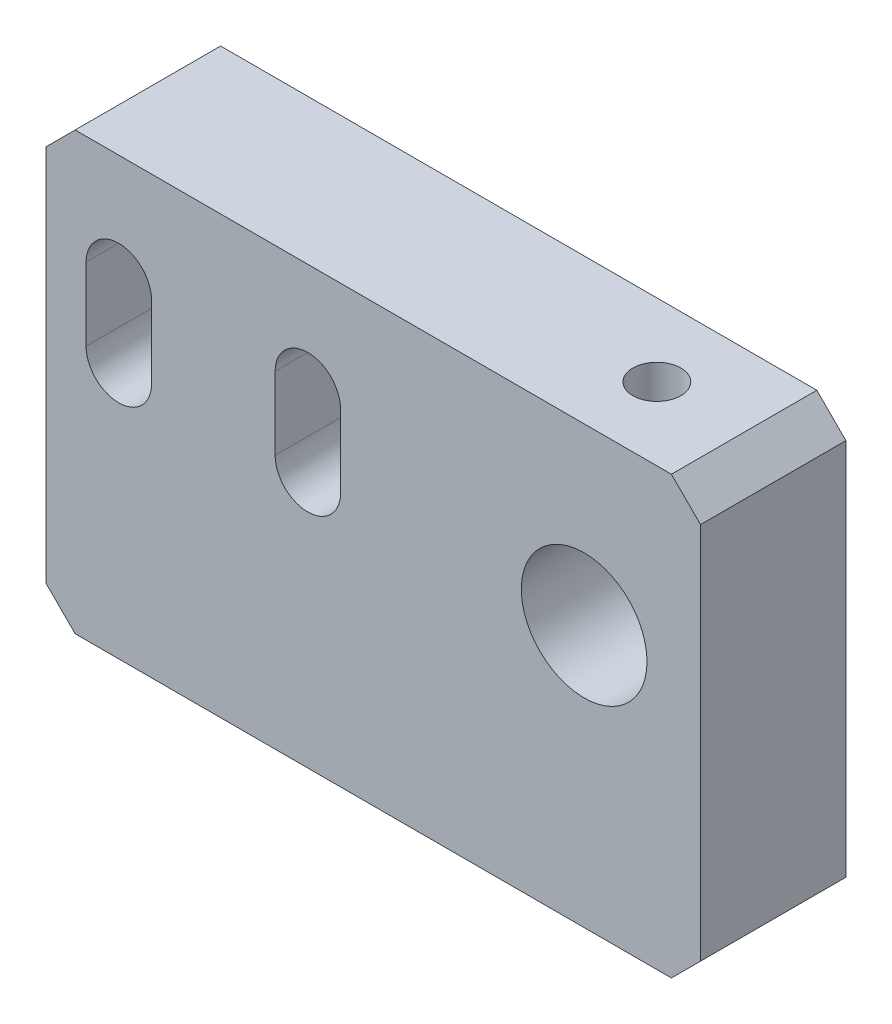
ISO-10303-21;
HEADER;
FILE_DESCRIPTION(('STEP AP214'),'2;1');
FILE_NAME('part.step','',(''),(''),'','','');
FILE_SCHEMA(('AUTOMOTIVE_DESIGN { 1 0 10303 214 1 1 1 1 }'));
ENDSEC;
DATA;
#1=APPLICATION_CONTEXT('core data for automotive mechanical design processes');
#2=APPLICATION_PROTOCOL_DEFINITION('international standard','automotive_design',2000,#1);
#3=PRODUCT_CONTEXT('',#1,'mechanical');
#4=PRODUCT('Part','Part','',(#3));
#5=PRODUCT_RELATED_PRODUCT_CATEGORY('part','',(#4));
#6=PRODUCT_DEFINITION_FORMATION('','',#4);
#7=PRODUCT_DEFINITION_CONTEXT('part definition',#1,'design');
#8=PRODUCT_DEFINITION('design','',#6,#7);
#9=PRODUCT_DEFINITION_SHAPE('','',#8);
#10=(LENGTH_UNIT() NAMED_UNIT(*) SI_UNIT(.MILLI.,.METRE.));
#11=(NAMED_UNIT(*) PLANE_ANGLE_UNIT() SI_UNIT($,.RADIAN.));
#12=(NAMED_UNIT(*) SI_UNIT($,.STERADIAN.) SOLID_ANGLE_UNIT());
#13=UNCERTAINTY_MEASURE_WITH_UNIT(LENGTH_MEASURE(1.E-05),#10,'distance_accuracy_value','');
#14=(GEOMETRIC_REPRESENTATION_CONTEXT(3) GLOBAL_UNCERTAINTY_ASSIGNED_CONTEXT((#13)) GLOBAL_UNIT_ASSIGNED_CONTEXT((#10,
#11,#12)) REPRESENTATION_CONTEXT('',''));
#15=CARTESIAN_POINT('',(0.,0.,0.));
#16=DIRECTION('',(0.,0.,1.));
#17=DIRECTION('',(1.,0.,0.));
#18=AXIS2_PLACEMENT_3D('',#15,#16,#17);
#19=CARTESIAN_POINT('',(0.,0.,10.));
#20=DIRECTION('',(0.,0.,1.));
#21=DIRECTION('',(1.,0.,0.));
#22=AXIS2_PLACEMENT_3D('',#19,#20,#21);
#23=PLANE('',#22);
#24=DIRECTION('',(0.,-1.,0.));
#25=VECTOR('',#24,1.);
#26=CARTESIAN_POINT('',(1.24253731343286,5.,10.));
#27=LINE('',#26,#25);
#28=CARTESIAN_POINT('',(1.24253731343286,5.,10.));
#29=VERTEX_POINT('',#28);
#30=CARTESIAN_POINT('',(1.24253731343286,0.,10.));
#31=VERTEX_POINT('',#30);
#32=EDGE_CURVE('E161',#29,#31,#27,.T.);
#33=ORIENTED_EDGE('',*,*,#32,.F.);
#34=CARTESIAN_POINT('',(3.49253731343286,5.,10.));
#35=DIRECTION('',(0.,0.,1.));
#36=DIRECTION('',(1.,0.,0.));
#37=AXIS2_PLACEMENT_3D('',#34,#35,#36);
#38=CIRCLE('',#37,2.25);
#39=CARTESIAN_POINT('',(5.74253731343286,5.,10.));
#40=VERTEX_POINT('',#39);
#41=EDGE_CURVE('E151',#40,#29,#38,.T.);
#42=ORIENTED_EDGE('',*,*,#41,.F.);
#43=DIRECTION('',(0.,1.,0.));
#44=VECTOR('',#43,1.);
#45=CARTESIAN_POINT('',(5.74253731343286,5.,10.));
#46=LINE('',#45,#44);
#47=CARTESIAN_POINT('',(5.74253731343286,0.,10.));
#48=VERTEX_POINT('',#47);
#49=EDGE_CURVE('E177',#48,#40,#46,.T.);
#50=ORIENTED_EDGE('',*,*,#49,.F.);
#51=CARTESIAN_POINT('',(3.49253731343286,0.,10.));
#52=DIRECTION('',(0.,0.,1.));
#53=DIRECTION('',(1.,0.,0.));
#54=AXIS2_PLACEMENT_3D('',#51,#52,#53);
#55=CIRCLE('',#54,2.25);
#56=EDGE_CURVE('E175',#31,#48,#55,.T.);
#57=ORIENTED_EDGE('',*,*,#56,.F.);
#58=EDGE_LOOP('',(#33,#42,#50,#57));
#59=FACE_BOUND('',#58,.T.);
#60=DIRECTION('',(0.,-1.,0.));
#61=VECTOR('',#60,1.);
#62=CARTESIAN_POINT('',(-11.7574626865671,5.,10.));
#63=LINE('',#62,#61);
#64=CARTESIAN_POINT('',(-11.7574626865671,5.,10.));
#65=VERTEX_POINT('',#64);
#66=CARTESIAN_POINT('',(-11.7574626865671,0.,10.));
#67=VERTEX_POINT('',#66);
#68=EDGE_CURVE('E197',#65,#67,#63,.T.);
#69=ORIENTED_EDGE('',*,*,#68,.F.);
#70=CARTESIAN_POINT('',(-9.50746268656714,5.,10.));
#71=DIRECTION('',(0.,0.,1.));
#72=DIRECTION('',(1.,0.,0.));
#73=AXIS2_PLACEMENT_3D('',#70,#71,#72);
#74=CIRCLE('',#73,2.25);
#75=CARTESIAN_POINT('',(-7.25746268656715,5.,10.));
#76=VERTEX_POINT('',#75);
#77=EDGE_CURVE('E195',#76,#65,#74,.T.);
#78=ORIENTED_EDGE('',*,*,#77,.F.);
#79=DIRECTION('',(0.,1.,0.));
#80=VECTOR('',#79,1.);
#81=CARTESIAN_POINT('',(-7.25746268656715,5.,10.));
#82=LINE('',#81,#80);
#83=CARTESIAN_POINT('',(-7.25746268656715,0.,10.));
#84=VERTEX_POINT('',#83);
#85=EDGE_CURVE('E203',#84,#76,#82,.T.);
#86=ORIENTED_EDGE('',*,*,#85,.F.);
#87=CARTESIAN_POINT('',(-9.50746268656714,0.,10.));
#88=DIRECTION('',(0.,0.,1.));
#89=DIRECTION('',(1.,0.,0.));
#90=AXIS2_PLACEMENT_3D('',#87,#88,#89);
#91=CIRCLE('',#90,2.25);
#92=EDGE_CURVE('E200',#67,#84,#91,.T.);
#93=ORIENTED_EDGE('',*,*,#92,.F.);
#94=EDGE_LOOP('',(#69,#78,#86,#93));
#95=FACE_BOUND('',#94,.T.);
#96=DIRECTION('',(-1.,0.,0.));
#97=VECTOR('',#96,1.);
#98=CARTESIAN_POINT('',(-14.5074626865671,12.5,10.));
#99=LINE('',#98,#97);
#100=CARTESIAN_POINT('',(28.4925373134328,12.5,10.));
#101=VERTEX_POINT('',#100);
#102=CARTESIAN_POINT('',(-12.5074626865671,12.5,10.));
#103=VERTEX_POINT('',#102);
#104=EDGE_CURVE('E234',#101,#103,#99,.T.);
#105=ORIENTED_EDGE('',*,*,#104,.T.);
#106=DIRECTION('',(0.707106781186548,0.707106781186548,0.));
#107=VECTOR('',#106,1.);
#108=CARTESIAN_POINT('',(-12.5037313432836,12.5037313432836,10.));
#109=LINE('',#108,#107);
#110=CARTESIAN_POINT('',(-14.5074626865671,10.5,10.));
#111=VERTEX_POINT('',#110);
#112=EDGE_CURVE('E318',#103,#111,#109,.F.);
#113=ORIENTED_EDGE('',*,*,#112,.T.);
#114=DIRECTION('',(0.,-1.,0.));
#115=VECTOR('',#114,1.);
#116=CARTESIAN_POINT('',(-14.5074626865671,12.5,10.));
#117=LINE('',#116,#115);
#118=CARTESIAN_POINT('',(-14.5074626865671,-15.5,10.));
#119=VERTEX_POINT('',#118);
#120=EDGE_CURVE('E226',#111,#119,#117,.T.);
#121=ORIENTED_EDGE('',*,*,#120,.T.);
#122=DIRECTION('',(-0.707106781186546,0.707106781186549,0.));
#123=VECTOR('',#122,1.);
#124=CARTESIAN_POINT('',(-15.0037313432836,-15.0037313432835,10.));
#125=LINE('',#124,#123);
#126=CARTESIAN_POINT('',(-12.5074626865671,-17.5,10.));
#127=VERTEX_POINT('',#126);
#128=EDGE_CURVE('E314',#119,#127,#125,.F.);
#129=ORIENTED_EDGE('',*,*,#128,.T.);
#130=DIRECTION('',(1.,0.,0.));
#131=VECTOR('',#130,1.);
#132=CARTESIAN_POINT('',(-14.5074626865671,-17.5,10.));
#133=LINE('',#132,#131);
#134=CARTESIAN_POINT('',(28.4925373134329,-17.5,10.));
#135=VERTEX_POINT('',#134);
#136=EDGE_CURVE('E229',#127,#135,#133,.T.);
#137=ORIENTED_EDGE('',*,*,#136,.T.);
#138=DIRECTION('',(-0.707106781186548,-0.707106781186548,0.));
#139=VECTOR('',#138,1.);
#140=CARTESIAN_POINT('',(22.9962686567164,-22.9962686567164,10.));
#141=LINE('',#140,#139);
#142=CARTESIAN_POINT('',(30.4925373134329,-15.5,10.));
#143=VERTEX_POINT('',#142);
#144=EDGE_CURVE('E57',#135,#143,#141,.F.);
#145=ORIENTED_EDGE('',*,*,#144,.T.);
#146=DIRECTION('',(0.,1.,0.));
#147=VECTOR('',#146,1.);
#148=CARTESIAN_POINT('',(30.4925373134329,12.5,10.));
#149=LINE('',#148,#147);
#150=CARTESIAN_POINT('',(30.4925373134329,10.5,10.));
#151=VERTEX_POINT('',#150);
#152=EDGE_CURVE('E232',#143,#151,#149,.T.);
#153=ORIENTED_EDGE('',*,*,#152,.T.);
#154=DIRECTION('',(0.707106781186546,-0.707106781186549,0.));
#155=VECTOR('',#154,1.);
#156=CARTESIAN_POINT('',(20.4962686567165,20.4962686567164,10.));
#157=LINE('',#156,#155);
#158=EDGE_CURVE('E316',#151,#101,#157,.F.);
#159=ORIENTED_EDGE('',*,*,#158,.T.);
#160=EDGE_LOOP('',(#105,#113,#121,#129,#137,#145,#153,#159));
#161=FACE_BOUND('',#160,.T.);
#162=CARTESIAN_POINT('',(22.4925373134329,0.499999999999997,10.));
#163=DIRECTION('',(0.,0.,1.));
#164=DIRECTION('',(1.,0.,0.));
#165=AXIS2_PLACEMENT_3D('',#162,#163,#164);
#166=CIRCLE('',#165,4.3220553698139);
#167=CARTESIAN_POINT('',(26.8145926832468,0.499999999999997,10.));
#168=VERTEX_POINT('',#167);
#169=EDGE_CURVE('E184',#168,#168,#166,.T.);
#170=ORIENTED_EDGE('',*,*,#169,.F.);
#171=EDGE_LOOP('',(#170));
#172=FACE_BOUND('',#171,.T.);
#173=ADVANCED_FACE('F35',(#59,#95,#161,#172),#23,.T.);
#174=CARTESIAN_POINT('',(0.,0.,0.));
#175=DIRECTION('',(0.,0.,1.));
#176=DIRECTION('',(1.,0.,0.));
#177=AXIS2_PLACEMENT_3D('',#174,#175,#176);
#178=PLANE('',#177);
#179=CARTESIAN_POINT('',(-9.50746268656714,5.,0.));
#180=DIRECTION('',(0.,0.,1.));
#181=DIRECTION('',(1.,0.,0.));
#182=AXIS2_PLACEMENT_3D('',#179,#180,#181);
#183=CIRCLE('',#182,2.25);
#184=CARTESIAN_POINT('',(-7.25746268656715,5.,0.));
#185=VERTEX_POINT('',#184);
#186=CARTESIAN_POINT('',(-11.7574626865671,5.,0.));
#187=VERTEX_POINT('',#186);
#188=EDGE_CURVE('E169',#185,#187,#183,.T.);
#189=ORIENTED_EDGE('',*,*,#188,.T.);
#190=DIRECTION('',(0.,-1.,0.));
#191=VECTOR('',#190,1.);
#192=CARTESIAN_POINT('',(-11.7574626865671,5.,0.));
#193=LINE('',#192,#191);
#194=CARTESIAN_POINT('',(-11.7574626865671,0.,0.));
#195=VERTEX_POINT('',#194);
#196=EDGE_CURVE('E208',#187,#195,#193,.T.);
#197=ORIENTED_EDGE('',*,*,#196,.T.);
#198=CARTESIAN_POINT('',(-9.50746268656714,0.,0.));
#199=DIRECTION('',(0.,0.,1.));
#200=DIRECTION('',(1.,0.,0.));
#201=AXIS2_PLACEMENT_3D('',#198,#199,#200);
#202=CIRCLE('',#201,2.25);
#203=CARTESIAN_POINT('',(-7.25746268656715,0.,0.));
#204=VERTEX_POINT('',#203);
#205=EDGE_CURVE('E211',#195,#204,#202,.T.);
#206=ORIENTED_EDGE('',*,*,#205,.T.);
#207=DIRECTION('',(0.,1.,0.));
#208=VECTOR('',#207,1.);
#209=CARTESIAN_POINT('',(-7.25746268656715,5.,0.));
#210=LINE('',#209,#208);
#211=EDGE_CURVE('E198',#204,#185,#210,.T.);
#212=ORIENTED_EDGE('',*,*,#211,.T.);
#213=EDGE_LOOP('',(#189,#197,#206,#212));
#214=FACE_BOUND('',#213,.T.);
#215=DIRECTION('',(0.,-1.,0.));
#216=VECTOR('',#215,1.);
#217=CARTESIAN_POINT('',(-14.5074626865671,12.5,0.));
#218=LINE('',#217,#216);
#219=CARTESIAN_POINT('',(-14.5074626865671,10.5,0.));
#220=VERTEX_POINT('',#219);
#221=CARTESIAN_POINT('',(-14.5074626865671,-15.5,0.));
#222=VERTEX_POINT('',#221);
#223=EDGE_CURVE('E225',#220,#222,#218,.T.);
#224=ORIENTED_EDGE('',*,*,#223,.F.);
#225=DIRECTION('',(-0.707106781186548,-0.707106781186548,0.));
#226=VECTOR('',#225,1.);
#227=CARTESIAN_POINT('',(-14.5074626865671,10.5,0.));
#228=LINE('',#227,#226);
#229=CARTESIAN_POINT('',(-12.5074626865671,12.5,0.));
#230=VERTEX_POINT('',#229);
#231=EDGE_CURVE('E341',#220,#230,#228,.F.);
#232=ORIENTED_EDGE('',*,*,#231,.T.);
#233=DIRECTION('',(-1.,0.,0.));
#234=VECTOR('',#233,1.);
#235=CARTESIAN_POINT('',(-14.5074626865671,12.5,0.));
#236=LINE('',#235,#234);
#237=CARTESIAN_POINT('',(28.4925373134328,12.5,0.));
#238=VERTEX_POINT('',#237);
#239=EDGE_CURVE('E230',#238,#230,#236,.T.);
#240=ORIENTED_EDGE('',*,*,#239,.F.);
#241=DIRECTION('',(-0.707106781186546,0.707106781186549,0.));
#242=VECTOR('',#241,1.);
#243=CARTESIAN_POINT('',(28.4925373134329,12.5,0.));
#244=LINE('',#243,#242);
#245=CARTESIAN_POINT('',(30.4925373134329,10.5,0.));
#246=VERTEX_POINT('',#245);
#247=EDGE_CURVE('E338',#238,#246,#244,.F.);
#248=ORIENTED_EDGE('',*,*,#247,.T.);
#249=DIRECTION('',(0.,1.,0.));
#250=VECTOR('',#249,1.);
#251=CARTESIAN_POINT('',(30.4925373134329,12.5,0.));
#252=LINE('',#251,#250);
#253=CARTESIAN_POINT('',(30.4925373134329,-15.5,0.));
#254=VERTEX_POINT('',#253);
#255=EDGE_CURVE('E243',#254,#246,#252,.T.);
#256=ORIENTED_EDGE('',*,*,#255,.F.);
#257=DIRECTION('',(0.707106781186548,0.707106781186548,0.));
#258=VECTOR('',#257,1.);
#259=CARTESIAN_POINT('',(30.4925373134329,-15.5,0.));
#260=LINE('',#259,#258);
#261=CARTESIAN_POINT('',(28.4925373134329,-17.5,0.));
#262=VERTEX_POINT('',#261);
#263=EDGE_CURVE('E332',#254,#262,#260,.F.);
#264=ORIENTED_EDGE('',*,*,#263,.T.);
#265=DIRECTION('',(1.,0.,0.));
#266=VECTOR('',#265,1.);
#267=CARTESIAN_POINT('',(-14.5074626865671,-17.5,0.));
#268=LINE('',#267,#266);
#269=CARTESIAN_POINT('',(-12.5074626865671,-17.5,0.));
#270=VERTEX_POINT('',#269);
#271=EDGE_CURVE('E240',#270,#262,#268,.T.);
#272=ORIENTED_EDGE('',*,*,#271,.F.);
#273=DIRECTION('',(0.707106781186546,-0.707106781186549,0.));
#274=VECTOR('',#273,1.);
#275=CARTESIAN_POINT('',(-12.5074626865671,-17.5,0.));
#276=LINE('',#275,#274);
#277=EDGE_CURVE('E342',#270,#222,#276,.F.);
#278=ORIENTED_EDGE('',*,*,#277,.T.);
#279=EDGE_LOOP('',(#224,#232,#240,#248,#256,#264,#272,#278));
#280=FACE_BOUND('',#279,.T.);
#281=CARTESIAN_POINT('',(3.49253731343286,5.,0.));
#282=DIRECTION('',(0.,0.,1.));
#283=DIRECTION('',(1.,0.,0.));
#284=AXIS2_PLACEMENT_3D('',#281,#282,#283);
#285=CIRCLE('',#284,2.25);
#286=CARTESIAN_POINT('',(5.74253731343286,5.,0.));
#287=VERTEX_POINT('',#286);
#288=CARTESIAN_POINT('',(1.24253731343286,5.,0.));
#289=VERTEX_POINT('',#288);
#290=EDGE_CURVE('E182',#287,#289,#285,.T.);
#291=ORIENTED_EDGE('',*,*,#290,.T.);
#292=DIRECTION('',(0.,-1.,0.));
#293=VECTOR('',#292,1.);
#294=CARTESIAN_POINT('',(1.24253731343286,5.,0.));
#295=LINE('',#294,#293);
#296=CARTESIAN_POINT('',(1.24253731343286,0.,0.));
#297=VERTEX_POINT('',#296);
#298=EDGE_CURVE('E168',#289,#297,#295,.T.);
#299=ORIENTED_EDGE('',*,*,#298,.T.);
#300=CARTESIAN_POINT('',(3.49253731343286,0.,0.));
#301=DIRECTION('',(0.,0.,1.));
#302=DIRECTION('',(1.,0.,0.));
#303=AXIS2_PLACEMENT_3D('',#300,#301,#302);
#304=CIRCLE('',#303,2.25);
#305=CARTESIAN_POINT('',(5.74253731343286,0.,0.));
#306=VERTEX_POINT('',#305);
#307=EDGE_CURVE('E186',#297,#306,#304,.T.);
#308=ORIENTED_EDGE('',*,*,#307,.T.);
#309=DIRECTION('',(0.,1.,0.));
#310=VECTOR('',#309,1.);
#311=CARTESIAN_POINT('',(5.74253731343286,5.,0.));
#312=LINE('',#311,#310);
#313=EDGE_CURVE('E162',#306,#287,#312,.T.);
#314=ORIENTED_EDGE('',*,*,#313,.T.);
#315=EDGE_LOOP('',(#291,#299,#308,#314));
#316=FACE_BOUND('',#315,.T.);
#317=CARTESIAN_POINT('',(22.4925373134329,0.499999999999997,0.));
#318=DIRECTION('',(0.,0.,1.));
#319=DIRECTION('',(1.,0.,0.));
#320=AXIS2_PLACEMENT_3D('',#317,#318,#319);
#321=CIRCLE('',#320,4.3220553698139);
#322=CARTESIAN_POINT('',(26.8145926832468,0.499999999999997,0.));
#323=VERTEX_POINT('',#322);
#324=EDGE_CURVE('E254',#323,#323,#321,.T.);
#325=ORIENTED_EDGE('',*,*,#324,.T.);
#326=EDGE_LOOP('',(#325));
#327=FACE_BOUND('',#326,.T.);
#328=ADVANCED_FACE('F276',(#214,#280,#316,#327),#178,.F.);
#329=CARTESIAN_POINT('',(-14.5074626865671,12.5,10.));
#330=DIRECTION('',(1.,0.,0.));
#331=DIRECTION('',(0.,1.,0.));
#332=AXIS2_PLACEMENT_3D('',#329,#330,#331);
#333=PLANE('',#332);
#334=ORIENTED_EDGE('',*,*,#120,.F.);
#335=DIRECTION('',(0.,0.,-1.));
#336=VECTOR('',#335,1.);
#337=CARTESIAN_POINT('',(-14.5074626865671,10.5,10.));
#338=LINE('',#337,#336);
#339=EDGE_CURVE('E357',#111,#220,#338,.T.);
#340=ORIENTED_EDGE('',*,*,#339,.T.);
#341=ORIENTED_EDGE('',*,*,#223,.T.);
#342=DIRECTION('',(0.,0.,1.));
#343=VECTOR('',#342,1.);
#344=CARTESIAN_POINT('',(-14.5074626865671,-15.5,10.));
#345=LINE('',#344,#343);
#346=EDGE_CURVE('E237',#222,#119,#345,.T.);
#347=ORIENTED_EDGE('',*,*,#346,.T.);
#348=EDGE_LOOP('',(#334,#340,#341,#347));
#349=FACE_BOUND('',#348,.T.);
#350=ADVANCED_FACE('F281',(#349),#333,.F.);
#351=CARTESIAN_POINT('',(-14.5074626865671,-17.5,10.));
#352=DIRECTION('',(0.,1.,0.));
#353=DIRECTION('',(0.,0.,1.));
#354=AXIS2_PLACEMENT_3D('',#351,#352,#353);
#355=PLANE('',#354);
#356=ORIENTED_EDGE('',*,*,#136,.F.);
#357=DIRECTION('',(0.,0.,-1.));
#358=VECTOR('',#357,1.);
#359=CARTESIAN_POINT('',(-12.5074626865671,-17.5,10.));
#360=LINE('',#359,#358);
#361=EDGE_CURVE('E11',#127,#270,#360,.T.);
#362=ORIENTED_EDGE('',*,*,#361,.T.);
#363=ORIENTED_EDGE('',*,*,#271,.T.);
#364=DIRECTION('',(0.,0.,1.));
#365=VECTOR('',#364,1.);
#366=CARTESIAN_POINT('',(28.4925373134329,-17.5,10.));
#367=LINE('',#366,#365);
#368=EDGE_CURVE('E43',#262,#135,#367,.T.);
#369=ORIENTED_EDGE('',*,*,#368,.T.);
#370=EDGE_LOOP('',(#356,#362,#363,#369));
#371=FACE_BOUND('',#370,.T.);
#372=ADVANCED_FACE('F295',(#371),#355,.F.);
#373=CARTESIAN_POINT('',(30.4925373134329,12.5,10.));
#374=DIRECTION('',(-1.,0.,0.));
#375=DIRECTION('',(0.,-1.,0.));
#376=AXIS2_PLACEMENT_3D('',#373,#374,#375);
#377=PLANE('',#376);
#378=ORIENTED_EDGE('',*,*,#255,.T.);
#379=DIRECTION('',(0.,0.,1.));
#380=VECTOR('',#379,1.);
#381=CARTESIAN_POINT('',(30.4925373134329,10.5,10.));
#382=LINE('',#381,#380);
#383=EDGE_CURVE('E50',#246,#151,#382,.T.);
#384=ORIENTED_EDGE('',*,*,#383,.T.);
#385=ORIENTED_EDGE('',*,*,#152,.F.);
#386=DIRECTION('',(0.,0.,-1.));
#387=VECTOR('',#386,1.);
#388=CARTESIAN_POINT('',(30.4925373134329,-15.5,10.));
#389=LINE('',#388,#387);
#390=EDGE_CURVE('E325',#143,#254,#389,.T.);
#391=ORIENTED_EDGE('',*,*,#390,.T.);
#392=EDGE_LOOP('',(#378,#384,#385,#391));
#393=FACE_BOUND('',#392,.T.);
#394=ADVANCED_FACE('F291',(#393),#377,.F.);
#395=CARTESIAN_POINT('',(-14.5074626865671,12.5,10.));
#396=DIRECTION('',(0.,-1.,0.));
#397=DIRECTION('',(0.,0.,-1.));
#398=AXIS2_PLACEMENT_3D('',#395,#396,#397);
#399=PLANE('',#398);
#400=CARTESIAN_POINT('',(22.4925373134329,12.5,5.));
#401=DIRECTION('',(0.,1.,0.));
#402=DIRECTION('',(0.,0.,1.));
#403=AXIS2_PLACEMENT_3D('',#400,#401,#402);
#404=CIRCLE('',#403,1.65);
#405=CARTESIAN_POINT('',(22.4925373134329,12.5,6.65));
#406=VERTEX_POINT('',#405);
#407=EDGE_CURVE('E255',#406,#406,#404,.T.);
#408=ORIENTED_EDGE('',*,*,#407,.F.);
#409=EDGE_LOOP('',(#408));
#410=FACE_BOUND('',#409,.T.);
#411=ORIENTED_EDGE('',*,*,#239,.T.);
#412=DIRECTION('',(0.,0.,1.));
#413=VECTOR('',#412,1.);
#414=CARTESIAN_POINT('',(-12.5074626865671,12.5,10.));
#415=LINE('',#414,#413);
#416=EDGE_CURVE('E320',#230,#103,#415,.T.);
#417=ORIENTED_EDGE('',*,*,#416,.T.);
#418=ORIENTED_EDGE('',*,*,#104,.F.);
#419=DIRECTION('',(0.,0.,-1.));
#420=VECTOR('',#419,1.);
#421=CARTESIAN_POINT('',(28.4925373134329,12.5,10.));
#422=LINE('',#421,#420);
#423=EDGE_CURVE('E344',#101,#238,#422,.T.);
#424=ORIENTED_EDGE('',*,*,#423,.T.);
#425=EDGE_LOOP('',(#411,#417,#418,#424));
#426=FACE_BOUND('',#425,.T.);
#427=ADVANCED_FACE('F288',(#410,#426),#399,.F.);
#428=CARTESIAN_POINT('',(-9.50746268656714,5.,10.));
#429=DIRECTION('',(0.,0.,-1.));
#430=DIRECTION('',(-1.,0.,0.));
#431=AXIS2_PLACEMENT_3D('',#428,#429,#430);
#432=CYLINDRICAL_SURFACE('',#431,2.25);
#433=ORIENTED_EDGE('',*,*,#188,.F.);
#434=DIRECTION('',(0.,0.,-1.));
#435=VECTOR('',#434,1.);
#436=CARTESIAN_POINT('',(-7.25746268656715,5.,10.));
#437=LINE('',#436,#435);
#438=EDGE_CURVE('E205',#76,#185,#437,.T.);
#439=ORIENTED_EDGE('',*,*,#438,.F.);
#440=ORIENTED_EDGE('',*,*,#77,.T.);
#441=DIRECTION('',(0.,0.,-1.));
#442=VECTOR('',#441,1.);
#443=CARTESIAN_POINT('',(-11.7574626865671,5.,10.));
#444=LINE('',#443,#442);
#445=EDGE_CURVE('E222',#65,#187,#444,.T.);
#446=ORIENTED_EDGE('',*,*,#445,.T.);
#447=EDGE_LOOP('',(#433,#439,#440,#446));
#448=FACE_BOUND('',#447,.T.);
#449=ADVANCED_FACE('F285',(#448),#432,.F.);
#450=CARTESIAN_POINT('',(-11.7574626865671,5.,10.));
#451=DIRECTION('',(1.,0.,0.));
#452=DIRECTION('',(0.,1.,0.));
#453=AXIS2_PLACEMENT_3D('',#450,#451,#452);
#454=PLANE('',#453);
#455=ORIENTED_EDGE('',*,*,#196,.F.);
#456=ORIENTED_EDGE('',*,*,#445,.F.);
#457=ORIENTED_EDGE('',*,*,#68,.T.);
#458=DIRECTION('',(0.,0.,-1.));
#459=VECTOR('',#458,1.);
#460=CARTESIAN_POINT('',(-11.7574626865671,0.,10.));
#461=LINE('',#460,#459);
#462=EDGE_CURVE('E220',#67,#195,#461,.T.);
#463=ORIENTED_EDGE('',*,*,#462,.T.);
#464=EDGE_LOOP('',(#455,#456,#457,#463));
#465=FACE_BOUND('',#464,.T.);
#466=ADVANCED_FACE('F390',(#465),#454,.T.);
#467=CARTESIAN_POINT('',(-9.50746268656714,0.,10.));
#468=DIRECTION('',(0.,0.,-1.));
#469=DIRECTION('',(-1.,0.,0.));
#470=AXIS2_PLACEMENT_3D('',#467,#468,#469);
#471=CYLINDRICAL_SURFACE('',#470,2.25);
#472=ORIENTED_EDGE('',*,*,#205,.F.);
#473=ORIENTED_EDGE('',*,*,#462,.F.);
#474=ORIENTED_EDGE('',*,*,#92,.T.);
#475=DIRECTION('',(0.,0.,-1.));
#476=VECTOR('',#475,1.);
#477=CARTESIAN_POINT('',(-7.25746268656715,0.,10.));
#478=LINE('',#477,#476);
#479=EDGE_CURVE('E218',#84,#204,#478,.T.);
#480=ORIENTED_EDGE('',*,*,#479,.T.);
#481=EDGE_LOOP('',(#472,#473,#474,#480));
#482=FACE_BOUND('',#481,.T.);
#483=ADVANCED_FACE('F387',(#482),#471,.F.);
#484=CARTESIAN_POINT('',(-7.25746268656715,5.,10.));
#485=DIRECTION('',(-1.,0.,0.));
#486=DIRECTION('',(0.,-1.,0.));
#487=AXIS2_PLACEMENT_3D('',#484,#485,#486);
#488=PLANE('',#487);
#489=ORIENTED_EDGE('',*,*,#211,.F.);
#490=ORIENTED_EDGE('',*,*,#479,.F.);
#491=ORIENTED_EDGE('',*,*,#85,.T.);
#492=ORIENTED_EDGE('',*,*,#438,.T.);
#493=EDGE_LOOP('',(#489,#490,#491,#492));
#494=FACE_BOUND('',#493,.T.);
#495=ADVANCED_FACE('F384',(#494),#488,.T.);
#496=CARTESIAN_POINT('',(3.49253731343286,5.,10.));
#497=DIRECTION('',(0.,0.,-1.));
#498=DIRECTION('',(-1.,0.,0.));
#499=AXIS2_PLACEMENT_3D('',#496,#497,#498);
#500=CYLINDRICAL_SURFACE('',#499,2.25);
#501=ORIENTED_EDGE('',*,*,#290,.F.);
#502=DIRECTION('',(0.,0.,-1.));
#503=VECTOR('',#502,1.);
#504=CARTESIAN_POINT('',(5.74253731343286,5.,10.));
#505=LINE('',#504,#503);
#506=EDGE_CURVE('E157',#40,#287,#505,.T.);
#507=ORIENTED_EDGE('',*,*,#506,.F.);
#508=ORIENTED_EDGE('',*,*,#41,.T.);
#509=DIRECTION('',(0.,0.,-1.));
#510=VECTOR('',#509,1.);
#511=CARTESIAN_POINT('',(1.24253731343286,5.,10.));
#512=LINE('',#511,#510);
#513=EDGE_CURVE('E154',#29,#289,#512,.T.);
#514=ORIENTED_EDGE('',*,*,#513,.T.);
#515=EDGE_LOOP('',(#501,#507,#508,#514));
#516=FACE_BOUND('',#515,.T.);
#517=ADVANCED_FACE('F153',(#516),#500,.F.);
#518=CARTESIAN_POINT('',(1.24253731343286,5.,10.));
#519=DIRECTION('',(1.,0.,0.));
#520=DIRECTION('',(0.,1.,0.));
#521=AXIS2_PLACEMENT_3D('',#518,#519,#520);
#522=PLANE('',#521);
#523=ORIENTED_EDGE('',*,*,#298,.F.);
#524=ORIENTED_EDGE('',*,*,#513,.F.);
#525=ORIENTED_EDGE('',*,*,#32,.T.);
#526=DIRECTION('',(0.,0.,-1.));
#527=VECTOR('',#526,1.);
#528=CARTESIAN_POINT('',(1.24253731343286,0.,10.));
#529=LINE('',#528,#527);
#530=EDGE_CURVE('E170',#31,#297,#529,.T.);
#531=ORIENTED_EDGE('',*,*,#530,.T.);
#532=EDGE_LOOP('',(#523,#524,#525,#531));
#533=FACE_BOUND('',#532,.T.);
#534=ADVANCED_FACE('F165',(#533),#522,.T.);
#535=CARTESIAN_POINT('',(3.49253731343286,0.,10.));
#536=DIRECTION('',(0.,0.,-1.));
#537=DIRECTION('',(-1.,0.,0.));
#538=AXIS2_PLACEMENT_3D('',#535,#536,#537);
#539=CYLINDRICAL_SURFACE('',#538,2.25);
#540=ORIENTED_EDGE('',*,*,#307,.F.);
#541=ORIENTED_EDGE('',*,*,#530,.F.);
#542=ORIENTED_EDGE('',*,*,#56,.T.);
#543=DIRECTION('',(0.,0.,-1.));
#544=VECTOR('',#543,1.);
#545=CARTESIAN_POINT('',(5.74253731343286,0.,10.));
#546=LINE('',#545,#544);
#547=EDGE_CURVE('E192',#48,#306,#546,.T.);
#548=ORIENTED_EDGE('',*,*,#547,.T.);
#549=EDGE_LOOP('',(#540,#541,#542,#548));
#550=FACE_BOUND('',#549,.T.);
#551=ADVANCED_FACE('F373',(#550),#539,.F.);
#552=CARTESIAN_POINT('',(5.74253731343286,5.,10.));
#553=DIRECTION('',(-1.,0.,0.));
#554=DIRECTION('',(0.,0.,1.));
#555=AXIS2_PLACEMENT_3D('',#552,#553,#554);
#556=PLANE('',#555);
#557=ORIENTED_EDGE('',*,*,#313,.F.);
#558=ORIENTED_EDGE('',*,*,#547,.F.);
#559=ORIENTED_EDGE('',*,*,#49,.T.);
#560=ORIENTED_EDGE('',*,*,#506,.T.);
#561=EDGE_LOOP('',(#557,#558,#559,#560));
#562=FACE_BOUND('',#561,.T.);
#563=ADVANCED_FACE('F272',(#562),#556,.T.);
#564=CARTESIAN_POINT('',(22.4925373134329,0.499999999999997,10.));
#565=DIRECTION('',(0.,0.,-1.));
#566=DIRECTION('',(-1.,0.,0.));
#567=AXIS2_PLACEMENT_3D('',#564,#565,#566);
#568=CYLINDRICAL_SURFACE('',#567,4.3220553698139);
#569=CARTESIAN_POINT('',(22.4925373134329,4.82205536981389,6.65));
#570=CARTESIAN_POINT('',(22.4032938389625,4.82205822106557,6.65000375823699));
#571=CARTESIAN_POINT('',(22.314075610598,4.8192674834933,6.64273720457046));
#572=CARTESIAN_POINT('',(22.1383117233759,4.80841440266491,6.61398572643211));
#573=CARTESIAN_POINT('',(22.0517655768685,4.80035302731625,6.59250341255406));
#574=CARTESIAN_POINT('',(21.8839065906989,4.77982208420426,6.53619511679138));
#575=CARTESIAN_POINT('',(21.8025837987337,4.76736121241446,6.50139544647553));
#576=CARTESIAN_POINT('',(21.6469381324274,4.73926728560711,6.41957663854932));
#577=CARTESIAN_POINT('',(21.5726172132326,4.72363334838989,6.37255410162216));
#578=CARTESIAN_POINT('',(21.4298311105728,4.69003718173834,6.26547639525656));
#579=CARTESIAN_POINT('',(21.3617127315655,4.67200742018458,6.20498016647892));
#580=CARTESIAN_POINT('',(21.2363065900335,4.63597774196729,6.07360864502692));
#581=CARTESIAN_POINT('',(21.1790223202135,4.61797783677629,6.00273001829397));
#582=CARTESIAN_POINT('',(21.0746647937494,4.5832524291724,5.84917036499742));
#583=CARTESIAN_POINT('',(21.0280883046348,4.56660609250013,5.76613203244716));
#584=CARTESIAN_POINT('',(20.9497170546694,4.53752754592801,5.59266580393105));
#585=CARTESIAN_POINT('',(20.9179161447994,4.52509358358699,5.50224100038078));
#586=CARTESIAN_POINT('',(20.8713792840628,4.50657164694013,5.32056627689586));
#587=CARTESIAN_POINT('',(20.8559797628948,4.50023799223624,5.22951224506774));
#588=CARTESIAN_POINT('',(20.8406084166529,4.49391658211521,5.04590905543576));
#589=CARTESIAN_POINT('',(20.8406299186079,4.49392608189394,4.95336056165053));
#590=CARTESIAN_POINT('',(20.8555938552663,4.5000786854285,4.7755452469595));
#591=CARTESIAN_POINT('',(20.8696053424893,4.50583909852796,4.6901843534034));
#592=CARTESIAN_POINT('',(20.9106089915554,4.52220680323838,4.52313241657593));
#593=CARTESIAN_POINT('',(20.9376031816707,4.53281485217684,4.44144194891204));
#594=CARTESIAN_POINT('',(21.0043011708277,4.55790608748435,4.28218916266038));
#595=CARTESIAN_POINT('',(21.0442406897214,4.57246025502614,4.20473724561779));
#596=CARTESIAN_POINT('',(21.1355310169757,4.60378130218731,4.0573687616317));
#597=CARTESIAN_POINT('',(21.1868858643854,4.62054896414537,3.98745487488053));
#598=CARTESIAN_POINT('',(21.3037711887493,4.65583595941669,3.85200882797355));
#599=CARTESIAN_POINT('',(21.370041306661,4.67439583424649,3.78712391295453));
#600=CARTESIAN_POINT('',(21.5127317136624,4.7101720396691,3.66919215318207));
#601=CARTESIAN_POINT('',(21.5891536750001,4.72738814816856,3.61614726262664));
#602=CARTESIAN_POINT('',(21.7516781433518,4.75890182902684,3.52265232796289));
#603=CARTESIAN_POINT('',(21.8379199120445,4.77314639343628,3.48242521919035));
#604=CARTESIAN_POINT('',(22.0166266369492,4.79671689385032,3.41726733243533));
#605=CARTESIAN_POINT('',(22.1090887024504,4.80604509703397,3.39232950293677));
#606=CARTESIAN_POINT('',(22.2921698018317,4.81832940346848,3.35971946059297));
#607=CARTESIAN_POINT('',(22.3826122561732,4.82160662699868,3.35117613834776));
#608=CARTESIAN_POINT('',(22.5636878269237,4.8224171476525,3.34905166696538));
#609=CARTESIAN_POINT('',(22.6543208943671,4.81995177383338,3.35546705580915));
#610=CARTESIAN_POINT('',(22.8293920293789,4.80976561842312,3.38242127922416));
#611=CARTESIAN_POINT('',(22.91393275423,4.80225966131247,3.40238313010252));
#612=CARTESIAN_POINT('',(23.0784006705398,4.7829648666307,3.45509722558371));
#613=CARTESIAN_POINT('',(23.1583272614595,4.77117547301143,3.48785113081008));
#614=CARTESIAN_POINT('',(23.3139666230295,4.74403650393575,3.56627284966486));
#615=CARTESIAN_POINT('',(23.3894831827114,4.72859141243451,3.61229599700882));
#616=CARTESIAN_POINT('',(23.5319783439591,4.69584069068095,3.71555023145634));
#617=CARTESIAN_POINT('',(23.5989536990399,4.67853435755643,3.77278555943526));
#618=CARTESIAN_POINT('',(23.7266829979407,4.64266958483986,3.90088754017785));
#619=CARTESIAN_POINT('',(23.7868203047888,4.62409845160209,3.97236708601458));
#620=CARTESIAN_POINT('',(23.8943761057946,4.58879250159551,4.12475947433952));
#621=CARTESIAN_POINT('',(23.9417932268312,4.57205788319029,4.20567333389346));
#622=CARTESIAN_POINT('',(24.0226717809918,4.54236653284176,4.3754421867484));
#623=CARTESIAN_POINT('',(24.0560550192786,4.52943108664172,4.46433841067939));
#624=CARTESIAN_POINT('',(24.1071485424737,4.50923465667024,4.64712543943858));
#625=CARTESIAN_POINT('',(24.1248690093508,4.50196998683103,4.74101295740121));
#626=CARTESIAN_POINT('',(24.1432067868963,4.49443887195986,4.92440858297005));
#627=CARTESIAN_POINT('',(24.1448805459011,4.49374021311013,5.0137941246741));
#628=CARTESIAN_POINT('',(24.1338020050892,4.49830566521169,5.19150283731875));
#629=CARTESIAN_POINT('',(24.1210511795926,4.50356916677752,5.27982611589963));
#630=CARTESIAN_POINT('',(24.0823191170594,4.51910025545849,5.44995535402516));
#631=CARTESIAN_POINT('',(24.0567854471121,4.52919808705031,5.53188005434636));
#632=CARTESIAN_POINT('',(23.9936130807268,4.5531555219611,5.69032671395615));
#633=CARTESIAN_POINT('',(23.9559712730342,4.56701609199405,5.76684727845148));
#634=CARTESIAN_POINT('',(23.8673048184403,4.59786408104389,5.91678964419717));
#635=CARTESIAN_POINT('',(23.8156693991233,4.61497955820945,5.98982357844395));
#636=CARTESIAN_POINT('',(23.7014126660699,4.64998195465707,6.12652666089371));
#637=CARTESIAN_POINT('',(23.6387877969231,4.66786912218692,6.19019276603512));
#638=CARTESIAN_POINT('',(23.5000739077087,4.70362215531029,6.31005248658478));
#639=CARTESIAN_POINT('',(23.4234215250575,4.72142889478218,6.36561477435761));
#640=CARTESIAN_POINT('',(23.2612394039697,4.7539505586274,6.46306095847461));
#641=CARTESIAN_POINT('',(23.1757084197197,4.76866504822895,6.50494293181838));
#642=CARTESIAN_POINT('',(22.9928434284157,4.79404816504067,6.57554594915939));
#643=CARTESIAN_POINT('',(22.8951113081796,4.80442863459443,6.60335024714454));
#644=CARTESIAN_POINT('',(22.6957528740881,4.81842875279264,6.64057007080182));
#645=CARTESIAN_POINT('',(22.5941287359359,4.82205212405598,6.64999572176403));
#646=CARTESIAN_POINT('',(22.4925373134329,4.82205536981389,6.65));
#647=B_SPLINE_CURVE_WITH_KNOTS('',3,(#569,#570,#571,#572,#573,#574,#575,#576,#577,#578,#579,
#580,#581,#582,#583,#584,#585,#586,#587,#588,#589,#590,#591,#592,#593,#594,#595,#596,#597,#598,
#599,#600,#601,#602,#603,#604,#605,#606,#607,#608,#609,#610,#611,#612,#613,#614,#615,#616,#617,
#618,#619,#620,#621,#622,#623,#624,#625,#626,#627,#628,#629,#630,#631,#632,#633,#634,#635,#636,
#637,#638,#639,#640,#641,#642,#643,#644,#645,#646),.UNSPECIFIED.,.T.,.F.,(4,2,2,2,2,2,2,2,2,2,2,
2,2,2,2,2,2,2,2,2,2,2,2,2,2,2,2,2,2,2,2,2,2,2,2,2,2,2,4),(0.,0.267355575957145,
0.534662068138675,0.801443137578175,1.068298481367,1.34568422494756,1.62315924039565,
1.91167078448016,2.2000621535436,2.4762821762525,2.75238267335788,3.01125824489315,
3.27017427339677,3.53409802206438,3.79811530309478,4.08057549939349,4.36308228137814,
4.65026379266473,4.93731275411811,5.20863453537735,5.47989352861038,5.74026915243291,
6.00067858862691,6.2688383926388,6.53709982146443,6.82149906790166,7.10592900238272,
7.3919233837392,7.67773171040349,7.94458314237367,8.21140730223064,8.46948168311197,
8.72762243071337,8.99964361734784,9.27175297364582,9.5593456657143,9.84697876643763,
10.151494134818,10.4558416900514),.UNSPECIFIED.);
#648=CARTESIAN_POINT('',(22.4925373134329,4.82205536981389,6.65));
#649=VERTEX_POINT('',#648);
#650=EDGE_CURVE('E247',#649,#649,#647,.T.);
#651=ORIENTED_EDGE('',*,*,#650,.F.);
#652=EDGE_LOOP('',(#651));
#653=FACE_BOUND('',#652,.T.);
#654=ORIENTED_EDGE('',*,*,#169,.T.);
#655=EDGE_LOOP('',(#654));
#656=FACE_BOUND('',#655,.T.);
#657=ORIENTED_EDGE('',*,*,#324,.F.);
#658=EDGE_LOOP('',(#657));
#659=FACE_BOUND('',#658,.T.);
#660=ADVANCED_FACE('F257',(#653,#656,#659),#568,.F.);
#661=CARTESIAN_POINT('',(22.4925373134329,12.5,5.));
#662=DIRECTION('',(0.,1.,0.));
#663=DIRECTION('',(0.,0.,1.));
#664=AXIS2_PLACEMENT_3D('',#661,#662,#663);
#665=CYLINDRICAL_SURFACE('',#664,1.65);
#666=ORIENTED_EDGE('',*,*,#650,.T.);
#667=EDGE_LOOP('',(#666));
#668=FACE_BOUND('',#667,.T.);
#669=ORIENTED_EDGE('',*,*,#407,.T.);
#670=EDGE_LOOP('',(#669));
#671=FACE_BOUND('',#670,.T.);
#672=ADVANCED_FACE('F260',(#668,#671),#665,.F.);
#673=CARTESIAN_POINT('',(-14.5074626865671,10.5,10.));
#674=DIRECTION('',(0.707106781186547,-0.707106781186547,0.));
#675=DIRECTION('',(0.,0.,-1.));
#676=AXIS2_PLACEMENT_3D('',#673,#674,#675);
#677=PLANE('',#676);
#678=ORIENTED_EDGE('',*,*,#112,.F.);
#679=ORIENTED_EDGE('',*,*,#416,.F.);
#680=ORIENTED_EDGE('',*,*,#231,.F.);
#681=ORIENTED_EDGE('',*,*,#339,.F.);
#682=EDGE_LOOP('',(#678,#679,#680,#681));
#683=FACE_BOUND('',#682,.T.);
#684=ADVANCED_FACE('F263',(#683),#677,.F.);
#685=CARTESIAN_POINT('',(28.4925373134329,12.5,10.));
#686=DIRECTION('',(-0.707106781186549,-0.707106781186546,0.));
#687=DIRECTION('',(0.,0.,-1.));
#688=AXIS2_PLACEMENT_3D('',#685,#686,#687);
#689=PLANE('',#688);
#690=ORIENTED_EDGE('',*,*,#158,.F.);
#691=ORIENTED_EDGE('',*,*,#383,.F.);
#692=ORIENTED_EDGE('',*,*,#247,.F.);
#693=ORIENTED_EDGE('',*,*,#423,.F.);
#694=EDGE_LOOP('',(#690,#691,#692,#693));
#695=FACE_BOUND('',#694,.T.);
#696=ADVANCED_FACE('F269',(#695),#689,.F.);
#697=CARTESIAN_POINT('',(-12.5074626865671,-17.5,10.));
#698=DIRECTION('',(0.707106781186549,0.707106781186546,0.));
#699=DIRECTION('',(0.,0.,-1.));
#700=AXIS2_PLACEMENT_3D('',#697,#698,#699);
#701=PLANE('',#700);
#702=ORIENTED_EDGE('',*,*,#128,.F.);
#703=ORIENTED_EDGE('',*,*,#346,.F.);
#704=ORIENTED_EDGE('',*,*,#277,.F.);
#705=ORIENTED_EDGE('',*,*,#361,.F.);
#706=EDGE_LOOP('',(#702,#703,#704,#705));
#707=FACE_BOUND('',#706,.T.);
#708=ADVANCED_FACE('F303',(#707),#701,.F.);
#709=CARTESIAN_POINT('',(30.4925373134329,-15.5,10.));
#710=DIRECTION('',(-0.707106781186548,0.707106781186548,0.));
#711=DIRECTION('',(0.,0.,-1.));
#712=AXIS2_PLACEMENT_3D('',#709,#710,#711);
#713=PLANE('',#712);
#714=ORIENTED_EDGE('',*,*,#144,.F.);
#715=ORIENTED_EDGE('',*,*,#368,.F.);
#716=ORIENTED_EDGE('',*,*,#263,.F.);
#717=ORIENTED_EDGE('',*,*,#390,.F.);
#718=EDGE_LOOP('',(#714,#715,#716,#717));
#719=FACE_BOUND('',#718,.T.);
#720=ADVANCED_FACE('F37',(#719),#713,.F.);
#721=CLOSED_SHELL('',(#173,#328,#350,#372,#394,#427,#449,#466,#483,#495,#517,#534,#551,#563,
#660,#672,#684,#696,#708,#720));
#722=MANIFOLD_SOLID_BREP('B2',#721);
#723=ADVANCED_BREP_SHAPE_REPRESENTATION('',(#18,#722),#14);
#724=SHAPE_DEFINITION_REPRESENTATION(#9,#723);
ENDSEC;
END-ISO-10303-21;
